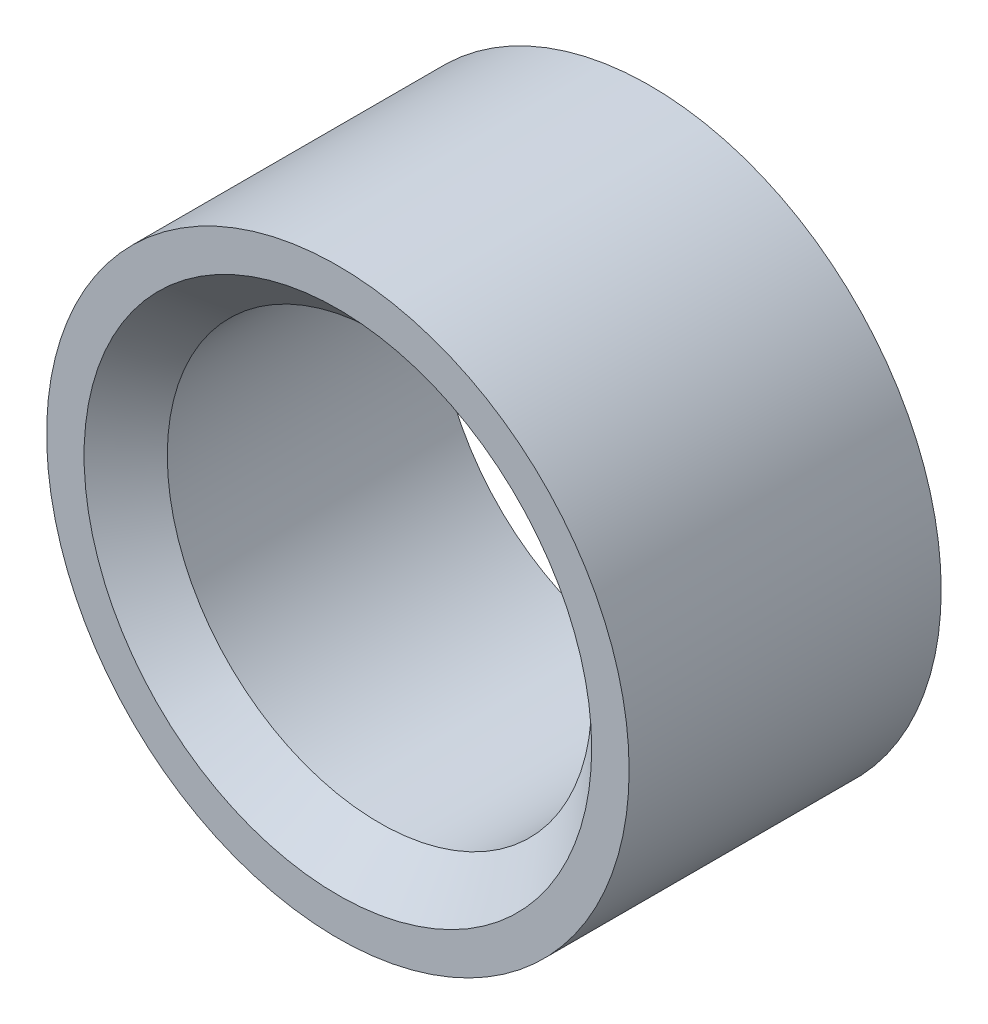
ISO-10303-21;
HEADER;
FILE_DESCRIPTION(('STEP AP214'),'2;1');
FILE_NAME('part.step','',(''),(''),'','','');
FILE_SCHEMA(('AUTOMOTIVE_DESIGN { 1 0 10303 214 1 1 1 1 }'));
ENDSEC;
DATA;
#1=APPLICATION_CONTEXT('core data for automotive mechanical design processes');
#2=APPLICATION_PROTOCOL_DEFINITION('international standard','automotive_design',2000,#1);
#3=PRODUCT_CONTEXT('',#1,'mechanical');
#4=PRODUCT('Part','Part','',(#3));
#5=PRODUCT_RELATED_PRODUCT_CATEGORY('part','',(#4));
#6=PRODUCT_DEFINITION_FORMATION('','',#4);
#7=PRODUCT_DEFINITION_CONTEXT('part definition',#1,'design');
#8=PRODUCT_DEFINITION('design','',#6,#7);
#9=PRODUCT_DEFINITION_SHAPE('','',#8);
#10=(LENGTH_UNIT() NAMED_UNIT(*) SI_UNIT(.MILLI.,.METRE.));
#11=(NAMED_UNIT(*) PLANE_ANGLE_UNIT() SI_UNIT($,.RADIAN.));
#12=(NAMED_UNIT(*) SI_UNIT($,.STERADIAN.) SOLID_ANGLE_UNIT());
#13=UNCERTAINTY_MEASURE_WITH_UNIT(LENGTH_MEASURE(1.E-05),#10,'distance_accuracy_value','');
#14=(GEOMETRIC_REPRESENTATION_CONTEXT(3) GLOBAL_UNCERTAINTY_ASSIGNED_CONTEXT((#13)) GLOBAL_UNIT_ASSIGNED_CONTEXT((#10,
#11,#12)) REPRESENTATION_CONTEXT('',''));
#15=CARTESIAN_POINT('',(0.,0.,0.));
#16=DIRECTION('',(0.,0.,1.));
#17=DIRECTION('',(1.,0.,0.));
#18=AXIS2_PLACEMENT_3D('',#15,#16,#17);
#19=CARTESIAN_POINT('',(0.,0.,15.));
#20=DIRECTION('',(0.,0.,1.));
#21=DIRECTION('',(1.,0.,0.));
#22=AXIS2_PLACEMENT_3D('',#19,#20,#21);
#23=PLANE('',#22);
#24=CARTESIAN_POINT('',(0.,0.,15.));
#25=DIRECTION('',(0.,0.,1.));
#26=DIRECTION('',(1.,0.,0.));
#27=AXIS2_PLACEMENT_3D('',#24,#25,#26);
#28=CIRCLE('',#27,12.2);
#29=CARTESIAN_POINT('',(12.2,0.,15.));
#30=VERTEX_POINT('',#29);
#31=EDGE_CURVE('E10',#30,#30,#28,.F.);
#32=ORIENTED_EDGE('',*,*,#31,.T.);
#33=EDGE_LOOP('',(#32));
#34=FACE_BOUND('',#33,.T.);
#35=CARTESIAN_POINT('',(0.,0.,15.));
#36=DIRECTION('',(0.,0.,1.));
#37=DIRECTION('',(1.,0.,0.));
#38=AXIS2_PLACEMENT_3D('',#35,#36,#37);
#39=CIRCLE('',#38,14.);
#40=CARTESIAN_POINT('',(14.,0.,15.));
#41=VERTEX_POINT('',#40);
#42=EDGE_CURVE('E54',#41,#41,#39,.T.);
#43=ORIENTED_EDGE('',*,*,#42,.T.);
#44=EDGE_LOOP('',(#43));
#45=FACE_BOUND('',#44,.T.);
#46=ADVANCED_FACE('F39',(#34,#45),#23,.T.);
#47=CARTESIAN_POINT('',(0.,0.,0.));
#48=DIRECTION('',(0.,0.,1.));
#49=DIRECTION('',(1.,0.,0.));
#50=AXIS2_PLACEMENT_3D('',#47,#48,#49);
#51=PLANE('',#50);
#52=CARTESIAN_POINT('',(0.,0.,0.));
#53=DIRECTION('',(0.,0.,1.));
#54=DIRECTION('',(1.,0.,0.));
#55=AXIS2_PLACEMENT_3D('',#52,#53,#54);
#56=CIRCLE('',#55,14.);
#57=CARTESIAN_POINT('',(14.,0.,0.));
#58=VERTEX_POINT('',#57);
#59=EDGE_CURVE('E60',#58,#58,#56,.T.);
#60=ORIENTED_EDGE('',*,*,#59,.F.);
#61=EDGE_LOOP('',(#60));
#62=FACE_BOUND('',#61,.T.);
#63=CARTESIAN_POINT('',(0.,0.,0.));
#64=DIRECTION('',(0.,0.,1.));
#65=DIRECTION('',(1.,0.,0.));
#66=AXIS2_PLACEMENT_3D('',#63,#64,#65);
#67=CIRCLE('',#66,10.2);
#68=CARTESIAN_POINT('',(10.2,0.,0.));
#69=VERTEX_POINT('',#68);
#70=EDGE_CURVE('E65',#69,#69,#67,.T.);
#71=ORIENTED_EDGE('',*,*,#70,.T.);
#72=EDGE_LOOP('',(#71));
#73=FACE_BOUND('',#72,.T.);
#74=ADVANCED_FACE('F72',(#62,#73),#51,.F.);
#75=CARTESIAN_POINT('',(0.,0.,15.));
#76=DIRECTION('',(0.,0.,-1.));
#77=DIRECTION('',(-1.,0.,0.));
#78=AXIS2_PLACEMENT_3D('',#75,#76,#77);
#79=CYLINDRICAL_SURFACE('',#78,14.);
#80=ORIENTED_EDGE('',*,*,#42,.F.);
#81=EDGE_LOOP('',(#80));
#82=FACE_BOUND('',#81,.T.);
#83=ORIENTED_EDGE('',*,*,#59,.T.);
#84=EDGE_LOOP('',(#83));
#85=FACE_BOUND('',#84,.T.);
#86=ADVANCED_FACE('F76',(#82,#85),#79,.T.);
#87=CARTESIAN_POINT('',(0.,0.,15.));
#88=DIRECTION('',(0.,0.,-1.));
#89=DIRECTION('',(-1.,0.,0.));
#90=AXIS2_PLACEMENT_3D('',#87,#88,#89);
#91=CYLINDRICAL_SURFACE('',#90,10.2);
#92=CARTESIAN_POINT('',(0.,0.,13.));
#93=DIRECTION('',(0.,0.,1.));
#94=DIRECTION('',(1.,0.,0.));
#95=AXIS2_PLACEMENT_3D('',#92,#93,#94);
#96=CIRCLE('',#95,10.2);
#97=CARTESIAN_POINT('',(10.2,0.,13.));
#98=VERTEX_POINT('',#97);
#99=EDGE_CURVE('E48',#98,#98,#96,.T.);
#100=ORIENTED_EDGE('',*,*,#99,.T.);
#101=EDGE_LOOP('',(#100));
#102=FACE_BOUND('',#101,.T.);
#103=ORIENTED_EDGE('',*,*,#70,.F.);
#104=EDGE_LOOP('',(#103));
#105=FACE_BOUND('',#104,.T.);
#106=ADVANCED_FACE('F74',(#102,#105),#91,.F.);
#107=CARTESIAN_POINT('',(0.,0.,13.));
#108=DIRECTION('',(0.,0.,1.));
#109=DIRECTION('',(1.,0.,0.));
#110=AXIS2_PLACEMENT_3D('',#107,#108,#109);
#111=CONICAL_SURFACE('',#110,10.2,0.785398163397451);
#112=ORIENTED_EDGE('',*,*,#31,.F.);
#113=EDGE_LOOP('',(#112));
#114=FACE_BOUND('',#113,.T.);
#115=ORIENTED_EDGE('',*,*,#99,.F.);
#116=EDGE_LOOP('',(#115));
#117=FACE_BOUND('',#116,.T.);
#118=ADVANCED_FACE('F42',(#114,#117),#111,.F.);
#119=CLOSED_SHELL('',(#46,#74,#86,#106,#118));
#120=MANIFOLD_SOLID_BREP('B2',#119);
#121=ADVANCED_BREP_SHAPE_REPRESENTATION('',(#18,#120),#14);
#122=SHAPE_DEFINITION_REPRESENTATION(#9,#121);
ENDSEC;
END-ISO-10303-21;
